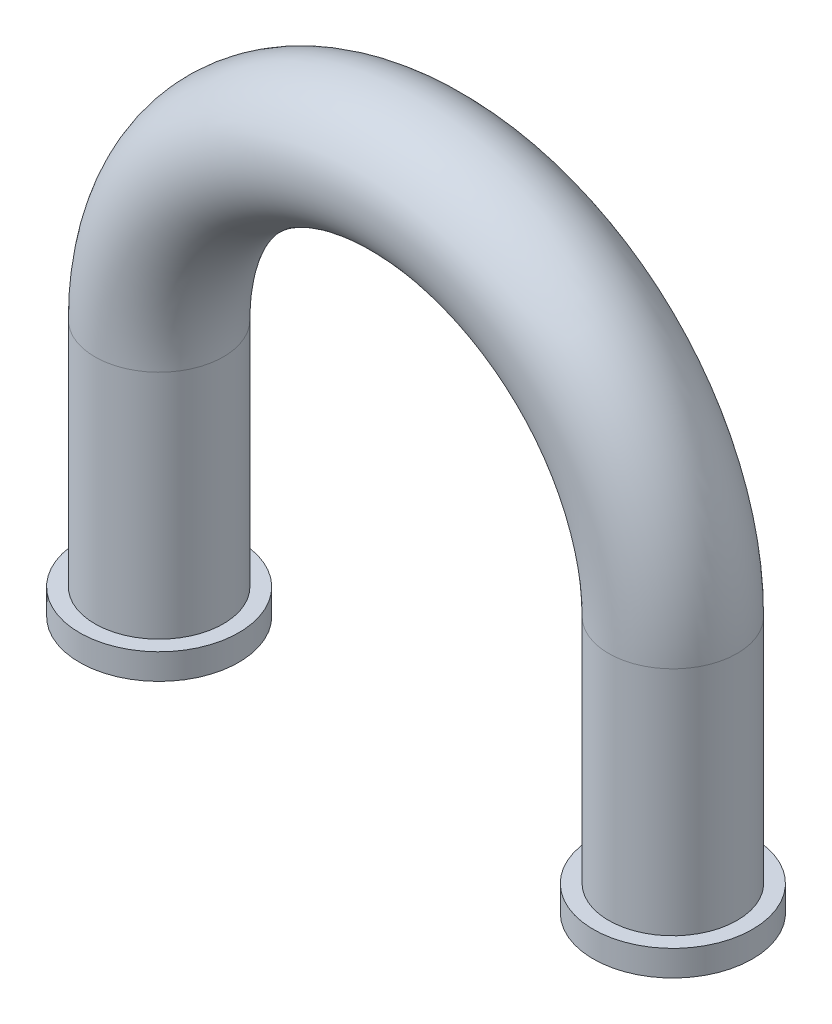
ISO-10303-21;
HEADER;
FILE_DESCRIPTION(('STEP AP214'),'2;1');
FILE_NAME('part.step','',(''),(''),'','','');
FILE_SCHEMA(('AUTOMOTIVE_DESIGN { 1 0 10303 214 1 1 1 1 }'));
ENDSEC;
DATA;
#1=APPLICATION_CONTEXT('core data for automotive mechanical design processes');
#2=APPLICATION_PROTOCOL_DEFINITION('international standard','automotive_design',2000,#1);
#3=PRODUCT_CONTEXT('',#1,'mechanical');
#4=PRODUCT('Part','Part','',(#3));
#5=PRODUCT_RELATED_PRODUCT_CATEGORY('part','',(#4));
#6=PRODUCT_DEFINITION_FORMATION('','',#4);
#7=PRODUCT_DEFINITION_CONTEXT('part definition',#1,'design');
#8=PRODUCT_DEFINITION('design','',#6,#7);
#9=PRODUCT_DEFINITION_SHAPE('','',#8);
#10=(LENGTH_UNIT() NAMED_UNIT(*) SI_UNIT(.MILLI.,.METRE.));
#11=(NAMED_UNIT(*) PLANE_ANGLE_UNIT() SI_UNIT($,.RADIAN.));
#12=(NAMED_UNIT(*) SI_UNIT($,.STERADIAN.) SOLID_ANGLE_UNIT());
#13=UNCERTAINTY_MEASURE_WITH_UNIT(LENGTH_MEASURE(1.E-05),#10,'distance_accuracy_value','');
#14=(GEOMETRIC_REPRESENTATION_CONTEXT(3) GLOBAL_UNCERTAINTY_ASSIGNED_CONTEXT((#13)) GLOBAL_UNIT_ASSIGNED_CONTEXT((#10,
#11,#12)) REPRESENTATION_CONTEXT('',''));
#15=CARTESIAN_POINT('',(0.,0.,0.));
#16=DIRECTION('',(0.,0.,1.));
#17=DIRECTION('',(1.,0.,0.));
#18=AXIS2_PLACEMENT_3D('',#15,#16,#17);
#19=CARTESIAN_POINT('',(1.,0.,0.));
#20=DIRECTION('',(0.,-1.,0.));
#21=DIRECTION('',(1.,0.,0.));
#22=AXIS2_PLACEMENT_3D('',#19,#20,#21);
#23=CYLINDRICAL_SURFACE('',#22,0.25);
#24=CARTESIAN_POINT('',(1.,0.,0.));
#25=DIRECTION('',(0.,-1.,0.));
#26=DIRECTION('',(1.,0.,0.));
#27=AXIS2_PLACEMENT_3D('',#24,#25,#26);
#28=CIRCLE('',#27,0.25);
#29=CARTESIAN_POINT('',(1.25,0.,0.));
#30=VERTEX_POINT('',#29);
#31=EDGE_CURVE('E10',#30,#30,#28,.T.);
#32=ORIENTED_EDGE('',*,*,#31,.T.);
#33=EDGE_LOOP('',(#32));
#34=FACE_BOUND('',#33,.T.);
#35=CARTESIAN_POINT('',(1.,-0.9,0.));
#36=DIRECTION('',(0.,-1.,0.));
#37=DIRECTION('',(1.,0.,0.));
#38=AXIS2_PLACEMENT_3D('',#35,#36,#37);
#39=CIRCLE('',#38,0.25);
#40=CARTESIAN_POINT('',(1.25,-0.9,0.));
#41=VERTEX_POINT('',#40);
#42=EDGE_CURVE('E35',#41,#41,#39,.F.);
#43=ORIENTED_EDGE('',*,*,#42,.T.);
#44=EDGE_LOOP('',(#43));
#45=FACE_BOUND('',#44,.T.);
#46=ADVANCED_FACE('F31',(#34,#45),#23,.T.);
#47=CARTESIAN_POINT('',(0.,0.,0.));
#48=DIRECTION('',(0.,0.,1.));
#49=DIRECTION('',(1.,0.,0.));
#50=AXIS2_PLACEMENT_3D('',#47,#48,#49);
#51=TOROIDAL_SURFACE('',#50,1.,0.25);
#52=CARTESIAN_POINT('',(-1.,0.,0.));
#53=DIRECTION('',(0.,1.,0.));
#54=DIRECTION('',(-1.,0.,0.));
#55=AXIS2_PLACEMENT_3D('',#52,#53,#54);
#56=CIRCLE('',#55,0.25);
#57=CARTESIAN_POINT('',(-1.25,0.,0.));
#58=VERTEX_POINT('',#57);
#59=EDGE_CURVE('E52',#58,#58,#56,.T.);
#60=CARTESIAN_POINT('',(0.,0.,0.));
#61=DIRECTION('',(0.,0.,1.));
#62=DIRECTION('',(1.,0.,0.));
#63=AXIS2_PLACEMENT_3D('',#60,#61,#62);
#64=CIRCLE('',#63,1.25);
#65=EDGE_CURVE('',#30,#58,#64,.T.);
#66=ORIENTED_EDGE('',*,*,#31,.F.);
#67=ORIENTED_EDGE('',*,*,#59,.T.);
#68=ORIENTED_EDGE('',*,*,#65,.T.);
#69=ORIENTED_EDGE('',*,*,#65,.F.);
#70=EDGE_LOOP('',(#66,#68,#67,#69));
#71=FACE_BOUND('',#70,.T.);
#72=ADVANCED_FACE('F33',(#71),#51,.T.);
#73=CARTESIAN_POINT('',(1.,-1.,0.));
#74=DIRECTION('',(0.,-1.,0.));
#75=DIRECTION('',(0.,0.,-1.));
#76=AXIS2_PLACEMENT_3D('',#73,#74,#75);
#77=PLANE('',#76);
#78=CARTESIAN_POINT('',(1.,-1.,0.));
#79=DIRECTION('',(0.,-1.,0.));
#80=DIRECTION('',(0.,0.,-1.));
#81=AXIS2_PLACEMENT_3D('',#78,#79,#80);
#82=CIRCLE('',#81,0.2);
#83=CARTESIAN_POINT('',(1.,-1.,-0.2));
#84=VERTEX_POINT('',#83);
#85=EDGE_CURVE('E39',#84,#84,#82,.T.);
#86=ORIENTED_EDGE('',*,*,#85,.F.);
#87=EDGE_LOOP('',(#86));
#88=FACE_BOUND('',#87,.T.);
#89=CARTESIAN_POINT('',(1.,-1.,0.));
#90=DIRECTION('',(0.,-1.,0.));
#91=DIRECTION('',(1.,0.,0.));
#92=AXIS2_PLACEMENT_3D('',#89,#90,#91);
#93=CIRCLE('',#92,0.31);
#94=CARTESIAN_POINT('',(1.31,-1.,0.));
#95=VERTEX_POINT('',#94);
#96=EDGE_CURVE('E48',#95,#95,#93,.T.);
#97=ORIENTED_EDGE('',*,*,#96,.T.);
#98=EDGE_LOOP('',(#97));
#99=FACE_BOUND('',#98,.T.);
#100=ADVANCED_FACE('F100',(#88,#99),#77,.T.);
#101=CARTESIAN_POINT('',(1.,0.,0.));
#102=DIRECTION('',(0.,-1.,0.));
#103=DIRECTION('',(1.,0.,0.));
#104=AXIS2_PLACEMENT_3D('',#101,#102,#103);
#105=CYLINDRICAL_SURFACE('',#104,0.2);
#106=CARTESIAN_POINT('',(1.,0.,0.));
#107=DIRECTION('',(0.,-1.,0.));
#108=DIRECTION('',(0.,0.,-1.));
#109=AXIS2_PLACEMENT_3D('',#106,#107,#108);
#110=CIRCLE('',#109,0.2);
#111=CARTESIAN_POINT('',(1.2,0.,0.));
#112=VERTEX_POINT('',#111);
#113=EDGE_CURVE('E43',#112,#112,#110,.T.);
#114=ORIENTED_EDGE('',*,*,#113,.F.);
#115=EDGE_LOOP('',(#114));
#116=FACE_BOUND('',#115,.T.);
#117=ORIENTED_EDGE('',*,*,#85,.T.);
#118=EDGE_LOOP('',(#117));
#119=FACE_BOUND('',#118,.T.);
#120=ADVANCED_FACE('F106',(#116,#119),#105,.F.);
#121=CARTESIAN_POINT('',(0.,0.,0.));
#122=DIRECTION('',(0.,0.,1.));
#123=DIRECTION('',(1.,0.,0.));
#124=AXIS2_PLACEMENT_3D('',#121,#122,#123);
#125=TOROIDAL_SURFACE('',#124,1.,0.2);
#126=CARTESIAN_POINT('',(-1.,0.,0.));
#127=DIRECTION('',(0.,1.,0.));
#128=DIRECTION('',(0.,0.,-1.));
#129=AXIS2_PLACEMENT_3D('',#126,#127,#128);
#130=CIRCLE('',#129,0.2);
#131=CARTESIAN_POINT('',(-1.2,0.,0.));
#132=VERTEX_POINT('',#131);
#133=EDGE_CURVE('E58',#132,#132,#130,.T.);
#134=CARTESIAN_POINT('',(0.,0.,0.));
#135=DIRECTION('',(0.,0.,1.));
#136=DIRECTION('',(1.,0.,0.));
#137=AXIS2_PLACEMENT_3D('',#134,#135,#136);
#138=CIRCLE('',#137,1.2);
#139=EDGE_CURVE('',#112,#132,#138,.T.);
#140=ORIENTED_EDGE('',*,*,#113,.T.);
#141=ORIENTED_EDGE('',*,*,#133,.F.);
#142=ORIENTED_EDGE('',*,*,#139,.T.);
#143=ORIENTED_EDGE('',*,*,#139,.F.);
#144=EDGE_LOOP('',(#140,#142,#141,#143));
#145=FACE_BOUND('',#144,.T.);
#146=ADVANCED_FACE('F110',(#145),#125,.F.);
#147=CARTESIAN_POINT('',(1.,-0.9,0.));
#148=DIRECTION('',(0.,-1.,0.));
#149=DIRECTION('',(0.,0.,-1.));
#150=AXIS2_PLACEMENT_3D('',#147,#148,#149);
#151=CYLINDRICAL_SURFACE('',#150,0.31);
#152=CARTESIAN_POINT('',(1.,-0.9,0.));
#153=DIRECTION('',(0.,-1.,0.));
#154=DIRECTION('',(1.,0.,0.));
#155=AXIS2_PLACEMENT_3D('',#152,#153,#154);
#156=CIRCLE('',#155,0.31);
#157=CARTESIAN_POINT('',(1.31,-0.9,0.));
#158=VERTEX_POINT('',#157);
#159=EDGE_CURVE('E51',#158,#158,#156,.T.);
#160=ORIENTED_EDGE('',*,*,#159,.T.);
#161=EDGE_LOOP('',(#160));
#162=FACE_BOUND('',#161,.T.);
#163=ORIENTED_EDGE('',*,*,#96,.F.);
#164=EDGE_LOOP('',(#163));
#165=FACE_BOUND('',#164,.T.);
#166=ADVANCED_FACE('F114',(#162,#165),#151,.T.);
#167=CARTESIAN_POINT('',(1.,-0.9,0.));
#168=DIRECTION('',(0.,-1.,0.));
#169=DIRECTION('',(1.,0.,0.));
#170=AXIS2_PLACEMENT_3D('',#167,#168,#169);
#171=PLANE('',#170);
#172=ORIENTED_EDGE('',*,*,#42,.F.);
#173=EDGE_LOOP('',(#172));
#174=FACE_BOUND('',#173,.T.);
#175=ORIENTED_EDGE('',*,*,#159,.F.);
#176=EDGE_LOOP('',(#175));
#177=FACE_BOUND('',#176,.T.);
#178=ADVANCED_FACE('F93',(#174,#177),#171,.F.);
#179=CARTESIAN_POINT('',(-1.,0.,0.));
#180=DIRECTION('',(0.,-1.,0.));
#181=DIRECTION('',(-1.,0.,0.));
#182=AXIS2_PLACEMENT_3D('',#179,#180,#181);
#183=CYLINDRICAL_SURFACE('',#182,0.25);
#184=ORIENTED_EDGE('',*,*,#59,.F.);
#185=EDGE_LOOP('',(#184));
#186=FACE_BOUND('',#185,.T.);
#187=CARTESIAN_POINT('',(-1.,-0.9,0.));
#188=DIRECTION('',(0.,1.,0.));
#189=DIRECTION('',(-1.,0.,0.));
#190=AXIS2_PLACEMENT_3D('',#187,#188,#189);
#191=CIRCLE('',#190,0.25);
#192=CARTESIAN_POINT('',(-1.25,-0.9,0.));
#193=VERTEX_POINT('',#192);
#194=EDGE_CURVE('E55',#193,#193,#191,.F.);
#195=ORIENTED_EDGE('',*,*,#194,.F.);
#196=EDGE_LOOP('',(#195));
#197=FACE_BOUND('',#196,.T.);
#198=ADVANCED_FACE('F84',(#186,#197),#183,.T.);
#199=CARTESIAN_POINT('',(-1.,-1.,0.));
#200=DIRECTION('',(0.,-1.,0.));
#201=DIRECTION('',(0.,0.,-1.));
#202=AXIS2_PLACEMENT_3D('',#199,#200,#201);
#203=PLANE('',#202);
#204=CARTESIAN_POINT('',(-1.,-1.,0.));
#205=DIRECTION('',(0.,1.,0.));
#206=DIRECTION('',(0.,0.,-1.));
#207=AXIS2_PLACEMENT_3D('',#204,#205,#206);
#208=CIRCLE('',#207,0.2);
#209=CARTESIAN_POINT('',(-1.,-1.,-0.2));
#210=VERTEX_POINT('',#209);
#211=EDGE_CURVE('E62',#210,#210,#208,.T.);
#212=ORIENTED_EDGE('',*,*,#211,.T.);
#213=EDGE_LOOP('',(#212));
#214=FACE_BOUND('',#213,.T.);
#215=CARTESIAN_POINT('',(-1.,-1.,0.));
#216=DIRECTION('',(0.,1.,0.));
#217=DIRECTION('',(-1.,0.,0.));
#218=AXIS2_PLACEMENT_3D('',#215,#216,#217);
#219=CIRCLE('',#218,0.31);
#220=CARTESIAN_POINT('',(-1.31,-1.,0.));
#221=VERTEX_POINT('',#220);
#222=EDGE_CURVE('E67',#221,#221,#219,.T.);
#223=ORIENTED_EDGE('',*,*,#222,.F.);
#224=EDGE_LOOP('',(#223));
#225=FACE_BOUND('',#224,.T.);
#226=ADVANCED_FACE('F82',(#214,#225),#203,.T.);
#227=CARTESIAN_POINT('',(-1.,0.,0.));
#228=DIRECTION('',(0.,-1.,0.));
#229=DIRECTION('',(-1.,0.,0.));
#230=AXIS2_PLACEMENT_3D('',#227,#228,#229);
#231=CYLINDRICAL_SURFACE('',#230,0.2);
#232=ORIENTED_EDGE('',*,*,#133,.T.);
#233=EDGE_LOOP('',(#232));
#234=FACE_BOUND('',#233,.T.);
#235=ORIENTED_EDGE('',*,*,#211,.F.);
#236=EDGE_LOOP('',(#235));
#237=FACE_BOUND('',#236,.T.);
#238=ADVANCED_FACE('F78',(#234,#237),#231,.F.);
#239=CARTESIAN_POINT('',(-1.,-0.9,0.));
#240=DIRECTION('',(0.,-1.,0.));
#241=DIRECTION('',(0.,0.,-1.));
#242=AXIS2_PLACEMENT_3D('',#239,#240,#241);
#243=CYLINDRICAL_SURFACE('',#242,0.31);
#244=CARTESIAN_POINT('',(-1.,-0.9,0.));
#245=DIRECTION('',(0.,1.,0.));
#246=DIRECTION('',(-1.,0.,0.));
#247=AXIS2_PLACEMENT_3D('',#244,#245,#246);
#248=CIRCLE('',#247,0.31);
#249=CARTESIAN_POINT('',(-1.31,-0.9,0.));
#250=VERTEX_POINT('',#249);
#251=EDGE_CURVE('E59',#250,#250,#248,.T.);
#252=ORIENTED_EDGE('',*,*,#251,.F.);
#253=EDGE_LOOP('',(#252));
#254=FACE_BOUND('',#253,.T.);
#255=ORIENTED_EDGE('',*,*,#222,.T.);
#256=EDGE_LOOP('',(#255));
#257=FACE_BOUND('',#256,.T.);
#258=ADVANCED_FACE('F75',(#254,#257),#243,.T.);
#259=CARTESIAN_POINT('',(-1.,-0.9,0.));
#260=DIRECTION('',(0.,-1.,0.));
#261=DIRECTION('',(-1.,0.,0.));
#262=AXIS2_PLACEMENT_3D('',#259,#260,#261);
#263=PLANE('',#262);
#264=ORIENTED_EDGE('',*,*,#194,.T.);
#265=EDGE_LOOP('',(#264));
#266=FACE_BOUND('',#265,.T.);
#267=ORIENTED_EDGE('',*,*,#251,.T.);
#268=EDGE_LOOP('',(#267));
#269=FACE_BOUND('',#268,.T.);
#270=ADVANCED_FACE('F73',(#266,#269),#263,.F.);
#271=CLOSED_SHELL('',(#46,#72,#100,#120,#146,#166,#178,#198,#226,#238,#258,#270));
#272=MANIFOLD_SOLID_BREP('B2',#271);
#273=ADVANCED_BREP_SHAPE_REPRESENTATION('',(#18,#272),#14);
#274=SHAPE_DEFINITION_REPRESENTATION(#9,#273);
ENDSEC;
END-ISO-10303-21;
